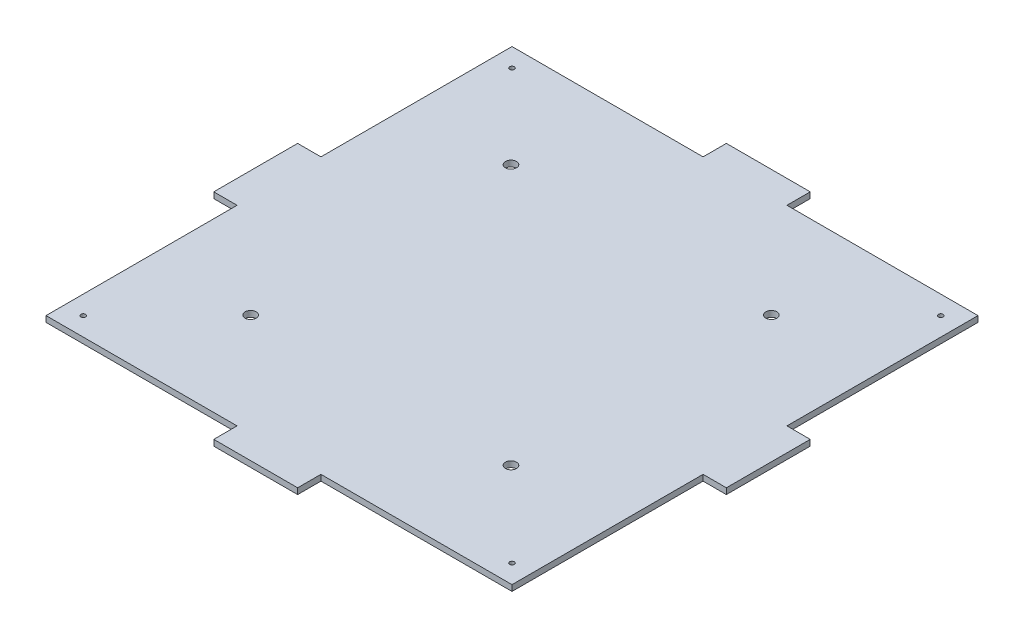
ISO-10303-21;
HEADER;
FILE_DESCRIPTION(('STEP AP214'),'2;1');
FILE_NAME('part.step','',(''),(''),'','','');
FILE_SCHEMA(('AUTOMOTIVE_DESIGN { 1 0 10303 214 1 1 1 1 }'));
ENDSEC;
DATA;
#1=APPLICATION_CONTEXT('core data for automotive mechanical design processes');
#2=APPLICATION_PROTOCOL_DEFINITION('international standard','automotive_design',2000,#1);
#3=PRODUCT_CONTEXT('',#1,'mechanical');
#4=PRODUCT('Part','Part','',(#3));
#5=PRODUCT_RELATED_PRODUCT_CATEGORY('part','',(#4));
#6=PRODUCT_DEFINITION_FORMATION('','',#4);
#7=PRODUCT_DEFINITION_CONTEXT('part definition',#1,'design');
#8=PRODUCT_DEFINITION('design','',#6,#7);
#9=PRODUCT_DEFINITION_SHAPE('','',#8);
#10=(LENGTH_UNIT() NAMED_UNIT(*) SI_UNIT(.MILLI.,.METRE.));
#11=(NAMED_UNIT(*) PLANE_ANGLE_UNIT() SI_UNIT($,.RADIAN.));
#12=(NAMED_UNIT(*) SI_UNIT($,.STERADIAN.) SOLID_ANGLE_UNIT());
#13=UNCERTAINTY_MEASURE_WITH_UNIT(LENGTH_MEASURE(1.E-05),#10,'distance_accuracy_value','');
#14=(GEOMETRIC_REPRESENTATION_CONTEXT(3) GLOBAL_UNCERTAINTY_ASSIGNED_CONTEXT((#13)) GLOBAL_UNIT_ASSIGNED_CONTEXT((#10,
#11,#12)) REPRESENTATION_CONTEXT('',''));
#15=CARTESIAN_POINT('',(0.,0.,0.));
#16=DIRECTION('',(0.,0.,1.));
#17=DIRECTION('',(1.,0.,0.));
#18=AXIS2_PLACEMENT_3D('',#15,#16,#17);
#19=CARTESIAN_POINT('',(0.,3.175,0.));
#20=DIRECTION('',(0.,-1.,0.));
#21=DIRECTION('',(0.,0.,-1.));
#22=AXIS2_PLACEMENT_3D('',#19,#20,#21);
#23=PLANE('',#22);
#24=CARTESIAN_POINT('',(69.2965591226744,3.175,69.85));
#25=DIRECTION('',(0.,1.,0.));
#26=DIRECTION('',(0.,0.,1.));
#27=AXIS2_PLACEMENT_3D('',#24,#25,#26);
#28=CIRCLE('',#27,2.9718);
#29=CARTESIAN_POINT('',(69.2965591226744,3.175,72.8218));
#30=VERTEX_POINT('',#29);
#31=EDGE_CURVE('E758',#30,#30,#28,.T.);
#32=ORIENTED_EDGE('',*,*,#31,.F.);
#33=EDGE_LOOP('',(#32));
#34=FACE_BOUND('',#33,.T.);
#35=CARTESIAN_POINT('',(69.2965591226744,3.175,-69.85));
#36=DIRECTION('',(0.,1.,0.));
#37=DIRECTION('',(0.,0.,1.));
#38=AXIS2_PLACEMENT_3D('',#35,#36,#37);
#39=CIRCLE('',#38,2.9718);
#40=CARTESIAN_POINT('',(69.2965591226744,3.175,-66.8782));
#41=VERTEX_POINT('',#40);
#42=EDGE_CURVE('E761',#41,#41,#39,.T.);
#43=ORIENTED_EDGE('',*,*,#42,.F.);
#44=EDGE_LOOP('',(#43));
#45=FACE_BOUND('',#44,.T.);
#46=CARTESIAN_POINT('',(-70.4034408773256,3.175,-69.85));
#47=DIRECTION('',(0.,1.,0.));
#48=DIRECTION('',(0.,0.,1.));
#49=AXIS2_PLACEMENT_3D('',#46,#47,#48);
#50=CIRCLE('',#49,2.9718);
#51=CARTESIAN_POINT('',(-70.4034408773256,3.175,-66.8782));
#52=VERTEX_POINT('',#51);
#53=EDGE_CURVE('E757',#52,#52,#50,.T.);
#54=ORIENTED_EDGE('',*,*,#53,.F.);
#55=EDGE_LOOP('',(#54));
#56=FACE_BOUND('',#55,.T.);
#57=CARTESIAN_POINT('',(-70.4034408773255,3.175,69.85));
#58=DIRECTION('',(0.,1.,0.));
#59=DIRECTION('',(0.,0.,1.));
#60=AXIS2_PLACEMENT_3D('',#57,#58,#59);
#61=CIRCLE('',#60,2.9718);
#62=CARTESIAN_POINT('',(-70.4034408773255,3.175,72.8218));
#63=VERTEX_POINT('',#62);
#64=EDGE_CURVE('E337',#63,#63,#61,.T.);
#65=ORIENTED_EDGE('',*,*,#64,.F.);
#66=EDGE_LOOP('',(#65));
#67=FACE_BOUND('',#66,.T.);
#68=CARTESIAN_POINT('',(115.,3.175,-115.));
#69=DIRECTION('',(0.,1.,0.));
#70=DIRECTION('',(0.,0.,1.));
#71=AXIS2_PLACEMENT_3D('',#68,#69,#70);
#72=CIRCLE('',#71,1.25000000000003);
#73=CARTESIAN_POINT('',(115.,3.175,-113.75));
#74=VERTEX_POINT('',#73);
#75=EDGE_CURVE('E326',#74,#74,#72,.F.);
#76=ORIENTED_EDGE('',*,*,#75,.T.);
#77=EDGE_LOOP('',(#76));
#78=FACE_BOUND('',#77,.T.);
#79=DIRECTION('',(0.,0.,-1.));
#80=VECTOR('',#79,1.);
#81=CARTESIAN_POINT('',(125.,3.175,125.));
#82=LINE('',#81,#80);
#83=CARTESIAN_POINT('',(125.,3.175,125.));
#84=VERTEX_POINT('',#83);
#85=CARTESIAN_POINT('',(125.,3.175,22.5));
#86=VERTEX_POINT('',#85);
#87=EDGE_CURVE('E289',#84,#86,#82,.T.);
#88=ORIENTED_EDGE('',*,*,#87,.T.);
#89=DIRECTION('',(-1.,0.,0.));
#90=VECTOR('',#89,1.);
#91=CARTESIAN_POINT('',(137.5,3.175,22.5));
#92=LINE('',#91,#90);
#93=CARTESIAN_POINT('',(137.5,3.175,22.5));
#94=VERTEX_POINT('',#93);
#95=EDGE_CURVE('E186',#94,#86,#92,.T.);
#96=ORIENTED_EDGE('',*,*,#95,.F.);
#97=DIRECTION('',(0.,0.,1.));
#98=VECTOR('',#97,1.);
#99=CARTESIAN_POINT('',(137.5,3.175,22.5));
#100=LINE('',#99,#98);
#101=CARTESIAN_POINT('',(137.5,3.175,-22.5));
#102=VERTEX_POINT('',#101);
#103=EDGE_CURVE('E179',#102,#94,#100,.T.);
#104=ORIENTED_EDGE('',*,*,#103,.F.);
#105=DIRECTION('',(-1.,0.,0.));
#106=VECTOR('',#105,1.);
#107=CARTESIAN_POINT('',(137.5,3.175,-22.5));
#108=LINE('',#107,#106);
#109=CARTESIAN_POINT('',(125.,3.175,-22.5));
#110=VERTEX_POINT('',#109);
#111=EDGE_CURVE('E183',#102,#110,#108,.T.);
#112=ORIENTED_EDGE('',*,*,#111,.T.);
#113=CARTESIAN_POINT('',(125.,3.175,-125.));
#114=VERTEX_POINT('',#113);
#115=EDGE_CURVE('E57',#110,#114,#82,.T.);
#116=ORIENTED_EDGE('',*,*,#115,.T.);
#117=DIRECTION('',(-1.,0.,0.));
#118=VECTOR('',#117,1.);
#119=CARTESIAN_POINT('',(-125.,3.175,-125.));
#120=LINE('',#119,#118);
#121=CARTESIAN_POINT('',(22.5,3.175,-125.));
#122=VERTEX_POINT('',#121);
#123=EDGE_CURVE('E292',#114,#122,#120,.T.);
#124=ORIENTED_EDGE('',*,*,#123,.T.);
#125=DIRECTION('',(0.,0.,1.));
#126=VECTOR('',#125,1.);
#127=CARTESIAN_POINT('',(22.5,3.175,-137.5));
#128=LINE('',#127,#126);
#129=CARTESIAN_POINT('',(22.5,3.175,-137.5));
#130=VERTEX_POINT('',#129);
#131=EDGE_CURVE('E282',#130,#122,#128,.T.);
#132=ORIENTED_EDGE('',*,*,#131,.F.);
#133=DIRECTION('',(1.,0.,0.));
#134=VECTOR('',#133,1.);
#135=CARTESIAN_POINT('',(22.5,3.175,-137.5));
#136=LINE('',#135,#134);
#137=CARTESIAN_POINT('',(-22.5,3.175,-137.5));
#138=VERTEX_POINT('',#137);
#139=EDGE_CURVE('E265',#138,#130,#136,.T.);
#140=ORIENTED_EDGE('',*,*,#139,.F.);
#141=DIRECTION('',(0.,0.,1.));
#142=VECTOR('',#141,1.);
#143=CARTESIAN_POINT('',(-22.5,3.175,-137.5));
#144=LINE('',#143,#142);
#145=CARTESIAN_POINT('',(-22.5,3.175,-125.));
#146=VERTEX_POINT('',#145);
#147=EDGE_CURVE('E285',#138,#146,#144,.T.);
#148=ORIENTED_EDGE('',*,*,#147,.T.);
#149=CARTESIAN_POINT('',(-125.,3.175,-125.));
#150=VERTEX_POINT('',#149);
#151=EDGE_CURVE('E291',#146,#150,#120,.T.);
#152=ORIENTED_EDGE('',*,*,#151,.T.);
#153=DIRECTION('',(0.,0.,1.));
#154=VECTOR('',#153,1.);
#155=CARTESIAN_POINT('',(-125.,3.175,125.));
#156=LINE('',#155,#154);
#157=CARTESIAN_POINT('',(-125.,3.175,-22.5));
#158=VERTEX_POINT('',#157);
#159=EDGE_CURVE('E296',#150,#158,#156,.T.);
#160=ORIENTED_EDGE('',*,*,#159,.T.);
#161=DIRECTION('',(1.,0.,0.));
#162=VECTOR('',#161,1.);
#163=CARTESIAN_POINT('',(-137.5,3.175,-22.5));
#164=LINE('',#163,#162);
#165=CARTESIAN_POINT('',(-137.5,3.175,-22.5));
#166=VERTEX_POINT('',#165);
#167=EDGE_CURVE('E255',#166,#158,#164,.T.);
#168=ORIENTED_EDGE('',*,*,#167,.F.);
#169=DIRECTION('',(0.,0.,-1.));
#170=VECTOR('',#169,1.);
#171=CARTESIAN_POINT('',(-137.5,3.175,-22.5));
#172=LINE('',#171,#170);
#173=CARTESIAN_POINT('',(-137.5,3.175,22.5));
#174=VERTEX_POINT('',#173);
#175=EDGE_CURVE('E238',#174,#166,#172,.T.);
#176=ORIENTED_EDGE('',*,*,#175,.F.);
#177=DIRECTION('',(1.,0.,0.));
#178=VECTOR('',#177,1.);
#179=CARTESIAN_POINT('',(-137.5,3.175,22.5));
#180=LINE('',#179,#178);
#181=CARTESIAN_POINT('',(-125.,3.175,22.5));
#182=VERTEX_POINT('',#181);
#183=EDGE_CURVE('E258',#174,#182,#180,.T.);
#184=ORIENTED_EDGE('',*,*,#183,.T.);
#185=CARTESIAN_POINT('',(-125.,3.175,125.));
#186=VERTEX_POINT('',#185);
#187=EDGE_CURVE('E295',#182,#186,#156,.T.);
#188=ORIENTED_EDGE('',*,*,#187,.T.);
#189=DIRECTION('',(1.,0.,0.));
#190=VECTOR('',#189,1.);
#191=CARTESIAN_POINT('',(-125.,3.175,125.));
#192=LINE('',#191,#190);
#193=CARTESIAN_POINT('',(-22.5,3.175,125.));
#194=VERTEX_POINT('',#193);
#195=EDGE_CURVE('E300',#186,#194,#192,.T.);
#196=ORIENTED_EDGE('',*,*,#195,.T.);
#197=DIRECTION('',(0.,0.,-1.));
#198=VECTOR('',#197,1.);
#199=CARTESIAN_POINT('',(-22.5,3.175,137.5));
#200=LINE('',#199,#198);
#201=CARTESIAN_POINT('',(-22.5,3.175,137.5));
#202=VERTEX_POINT('',#201);
#203=EDGE_CURVE('E228',#202,#194,#200,.T.);
#204=ORIENTED_EDGE('',*,*,#203,.F.);
#205=DIRECTION('',(-1.,0.,0.));
#206=VECTOR('',#205,1.);
#207=CARTESIAN_POINT('',(-22.5,3.175,137.5));
#208=LINE('',#207,#206);
#209=CARTESIAN_POINT('',(22.5,3.175,137.5));
#210=VERTEX_POINT('',#209);
#211=EDGE_CURVE('E214',#210,#202,#208,.T.);
#212=ORIENTED_EDGE('',*,*,#211,.F.);
#213=DIRECTION('',(0.,0.,-1.));
#214=VECTOR('',#213,1.);
#215=CARTESIAN_POINT('',(22.5,3.175,137.5));
#216=LINE('',#215,#214);
#217=CARTESIAN_POINT('',(22.5,3.175,125.));
#218=VERTEX_POINT('',#217);
#219=EDGE_CURVE('E231',#210,#218,#216,.T.);
#220=ORIENTED_EDGE('',*,*,#219,.T.);
#221=EDGE_CURVE('E299',#218,#84,#192,.T.);
#222=ORIENTED_EDGE('',*,*,#221,.T.);
#223=EDGE_LOOP('',(#88,#96,#104,#112,#116,#124,#132,#140,#148,#152,#160,#168,#176,#184,#188,
#196,#204,#212,#220,#222));
#224=FACE_BOUND('',#223,.T.);
#225=CARTESIAN_POINT('',(-115.,3.175,-115.));
#226=DIRECTION('',(0.,1.,0.));
#227=DIRECTION('',(0.,0.,1.));
#228=AXIS2_PLACEMENT_3D('',#225,#226,#227);
#229=CIRCLE('',#228,1.25);
#230=CARTESIAN_POINT('',(-115.,3.175,-113.75));
#231=VERTEX_POINT('',#230);
#232=EDGE_CURVE('E332',#231,#231,#229,.T.);
#233=ORIENTED_EDGE('',*,*,#232,.F.);
#234=EDGE_LOOP('',(#233));
#235=FACE_BOUND('',#234,.T.);
#236=CARTESIAN_POINT('',(-115.,3.175,115.));
#237=DIRECTION('',(0.,-1.,0.));
#238=DIRECTION('',(0.,0.,-1.));
#239=AXIS2_PLACEMENT_3D('',#236,#237,#238);
#240=CIRCLE('',#239,1.25);
#241=CARTESIAN_POINT('',(-115.,3.175,113.75));
#242=VERTEX_POINT('',#241);
#243=EDGE_CURVE('E344',#242,#242,#240,.T.);
#244=ORIENTED_EDGE('',*,*,#243,.T.);
#245=EDGE_LOOP('',(#244));
#246=FACE_BOUND('',#245,.T.);
#247=CARTESIAN_POINT('',(115.,3.175,115.));
#248=DIRECTION('',(0.,1.,0.));
#249=DIRECTION('',(0.,0.,1.));
#250=AXIS2_PLACEMENT_3D('',#247,#248,#249);
#251=CIRCLE('',#250,1.25000000000003);
#252=CARTESIAN_POINT('',(115.,3.175,116.25));
#253=VERTEX_POINT('',#252);
#254=EDGE_CURVE('E348',#253,#253,#251,.T.);
#255=ORIENTED_EDGE('',*,*,#254,.F.);
#256=EDGE_LOOP('',(#255));
#257=FACE_BOUND('',#256,.T.);
#258=ADVANCED_FACE('F40',(#34,#45,#56,#67,#78,#224,#235,#246,#257),#23,.F.);
#259=CARTESIAN_POINT('',(0.,0.,0.));
#260=DIRECTION('',(0.,-1.,0.));
#261=DIRECTION('',(0.,0.,-1.));
#262=AXIS2_PLACEMENT_3D('',#259,#260,#261);
#263=PLANE('',#262);
#264=CARTESIAN_POINT('',(69.2965591226744,0.,69.85));
#265=DIRECTION('',(0.,-1.,0.));
#266=DIRECTION('',(0.,0.,-1.));
#267=AXIS2_PLACEMENT_3D('',#264,#265,#266);
#268=CIRCLE('',#267,2.9718);
#269=CARTESIAN_POINT('',(69.2965591226744,0.,66.8782));
#270=VERTEX_POINT('',#269);
#271=EDGE_CURVE('E44',#270,#270,#268,.T.);
#272=ORIENTED_EDGE('',*,*,#271,.F.);
#273=EDGE_LOOP('',(#272));
#274=FACE_BOUND('',#273,.T.);
#275=CARTESIAN_POINT('',(69.2965591226744,0.,-69.85));
#276=DIRECTION('',(0.,-1.,0.));
#277=DIRECTION('',(0.,0.,-1.));
#278=AXIS2_PLACEMENT_3D('',#275,#276,#277);
#279=CIRCLE('',#278,2.9718);
#280=CARTESIAN_POINT('',(69.2965591226744,0.,-72.8218));
#281=VERTEX_POINT('',#280);
#282=EDGE_CURVE('E339',#281,#281,#279,.T.);
#283=ORIENTED_EDGE('',*,*,#282,.F.);
#284=EDGE_LOOP('',(#283));
#285=FACE_BOUND('',#284,.T.);
#286=CARTESIAN_POINT('',(-70.4034408773256,0.,-69.85));
#287=DIRECTION('',(0.,-1.,0.));
#288=DIRECTION('',(0.,0.,-1.));
#289=AXIS2_PLACEMENT_3D('',#286,#287,#288);
#290=CIRCLE('',#289,2.9718);
#291=CARTESIAN_POINT('',(-70.4034408773256,0.,-72.8218));
#292=VERTEX_POINT('',#291);
#293=EDGE_CURVE('E336',#292,#292,#290,.T.);
#294=ORIENTED_EDGE('',*,*,#293,.F.);
#295=EDGE_LOOP('',(#294));
#296=FACE_BOUND('',#295,.T.);
#297=CARTESIAN_POINT('',(-70.4034408773255,0.,69.85));
#298=DIRECTION('',(0.,-1.,0.));
#299=DIRECTION('',(0.,0.,-1.));
#300=AXIS2_PLACEMENT_3D('',#297,#298,#299);
#301=CIRCLE('',#300,2.9718);
#302=CARTESIAN_POINT('',(-70.4034408773255,0.,66.8782));
#303=VERTEX_POINT('',#302);
#304=EDGE_CURVE('E333',#303,#303,#301,.T.);
#305=ORIENTED_EDGE('',*,*,#304,.F.);
#306=EDGE_LOOP('',(#305));
#307=FACE_BOUND('',#306,.T.);
#308=CARTESIAN_POINT('',(115.,0.,-115.));
#309=DIRECTION('',(0.,-1.,0.));
#310=DIRECTION('',(0.,0.,-1.));
#311=AXIS2_PLACEMENT_3D('',#308,#309,#310);
#312=CIRCLE('',#311,1.25000000000003);
#313=CARTESIAN_POINT('',(115.,0.,-116.25));
#314=VERTEX_POINT('',#313);
#315=EDGE_CURVE('E329',#314,#314,#312,.F.);
#316=ORIENTED_EDGE('',*,*,#315,.T.);
#317=EDGE_LOOP('',(#316));
#318=FACE_BOUND('',#317,.T.);
#319=CARTESIAN_POINT('',(-115.,0.,115.));
#320=DIRECTION('',(0.,-1.,0.));
#321=DIRECTION('',(0.,0.,-1.));
#322=AXIS2_PLACEMENT_3D('',#319,#320,#321);
#323=CIRCLE('',#322,1.25);
#324=CARTESIAN_POINT('',(-115.,0.,113.75));
#325=VERTEX_POINT('',#324);
#326=EDGE_CURVE('E322',#325,#325,#323,.F.);
#327=ORIENTED_EDGE('',*,*,#326,.T.);
#328=EDGE_LOOP('',(#327));
#329=FACE_BOUND('',#328,.T.);
#330=CARTESIAN_POINT('',(-115.,0.,-115.));
#331=DIRECTION('',(0.,1.,0.));
#332=DIRECTION('',(0.,0.,1.));
#333=AXIS2_PLACEMENT_3D('',#330,#331,#332);
#334=CIRCLE('',#333,1.25);
#335=CARTESIAN_POINT('',(-115.,0.,-113.75));
#336=VERTEX_POINT('',#335);
#337=EDGE_CURVE('E358',#336,#336,#334,.T.);
#338=ORIENTED_EDGE('',*,*,#337,.T.);
#339=EDGE_LOOP('',(#338));
#340=FACE_BOUND('',#339,.T.);
#341=DIRECTION('',(0.,0.,-1.));
#342=VECTOR('',#341,1.);
#343=CARTESIAN_POINT('',(125.,0.,125.));
#344=LINE('',#343,#342);
#345=CARTESIAN_POINT('',(125.,0.,125.));
#346=VERTEX_POINT('',#345);
#347=CARTESIAN_POINT('',(125.,0.,22.5));
#348=VERTEX_POINT('',#347);
#349=EDGE_CURVE('E304',#346,#348,#344,.T.);
#350=ORIENTED_EDGE('',*,*,#349,.F.);
#351=DIRECTION('',(1.,0.,0.));
#352=VECTOR('',#351,1.);
#353=CARTESIAN_POINT('',(-125.,0.,125.));
#354=LINE('',#353,#352);
#355=CARTESIAN_POINT('',(22.5,0.,125.));
#356=VERTEX_POINT('',#355);
#357=EDGE_CURVE('E312',#356,#346,#354,.T.);
#358=ORIENTED_EDGE('',*,*,#357,.F.);
#359=DIRECTION('',(0.,0.,-1.));
#360=VECTOR('',#359,1.);
#361=CARTESIAN_POINT('',(22.5,0.,137.5));
#362=LINE('',#361,#360);
#363=CARTESIAN_POINT('',(22.5,0.,137.5));
#364=VERTEX_POINT('',#363);
#365=EDGE_CURVE('E219',#364,#356,#362,.T.);
#366=ORIENTED_EDGE('',*,*,#365,.F.);
#367=DIRECTION('',(1.,0.,0.));
#368=VECTOR('',#367,1.);
#369=CARTESIAN_POINT('',(-22.5,0.,137.5));
#370=LINE('',#369,#368);
#371=CARTESIAN_POINT('',(-22.5,0.,137.5));
#372=VERTEX_POINT('',#371);
#373=EDGE_CURVE('E218',#372,#364,#370,.T.);
#374=ORIENTED_EDGE('',*,*,#373,.F.);
#375=DIRECTION('',(0.,0.,-1.));
#376=VECTOR('',#375,1.);
#377=CARTESIAN_POINT('',(-22.5,0.,137.5));
#378=LINE('',#377,#376);
#379=CARTESIAN_POINT('',(-22.5,0.,125.));
#380=VERTEX_POINT('',#379);
#381=EDGE_CURVE('E225',#372,#380,#378,.T.);
#382=ORIENTED_EDGE('',*,*,#381,.T.);
#383=CARTESIAN_POINT('',(-125.,0.,125.));
#384=VERTEX_POINT('',#383);
#385=EDGE_CURVE('E313',#384,#380,#354,.T.);
#386=ORIENTED_EDGE('',*,*,#385,.F.);
#387=DIRECTION('',(0.,0.,1.));
#388=VECTOR('',#387,1.);
#389=CARTESIAN_POINT('',(-125.,0.,125.));
#390=LINE('',#389,#388);
#391=CARTESIAN_POINT('',(-125.,0.,22.5));
#392=VERTEX_POINT('',#391);
#393=EDGE_CURVE('E309',#392,#384,#390,.T.);
#394=ORIENTED_EDGE('',*,*,#393,.F.);
#395=DIRECTION('',(1.,0.,0.));
#396=VECTOR('',#395,1.);
#397=CARTESIAN_POINT('',(-137.5,0.,22.5));
#398=LINE('',#397,#396);
#399=CARTESIAN_POINT('',(-137.5,0.,22.5));
#400=VERTEX_POINT('',#399);
#401=EDGE_CURVE('E245',#400,#392,#398,.T.);
#402=ORIENTED_EDGE('',*,*,#401,.F.);
#403=DIRECTION('',(0.,0.,1.));
#404=VECTOR('',#403,1.);
#405=CARTESIAN_POINT('',(-137.5,0.,-22.5));
#406=LINE('',#405,#404);
#407=CARTESIAN_POINT('',(-137.5,0.,-22.5));
#408=VERTEX_POINT('',#407);
#409=EDGE_CURVE('E243',#408,#400,#406,.T.);
#410=ORIENTED_EDGE('',*,*,#409,.F.);
#411=DIRECTION('',(1.,0.,0.));
#412=VECTOR('',#411,1.);
#413=CARTESIAN_POINT('',(-137.5,0.,-22.5));
#414=LINE('',#413,#412);
#415=CARTESIAN_POINT('',(-125.,0.,-22.5));
#416=VERTEX_POINT('',#415);
#417=EDGE_CURVE('E252',#408,#416,#414,.T.);
#418=ORIENTED_EDGE('',*,*,#417,.T.);
#419=CARTESIAN_POINT('',(-125.,0.,-125.));
#420=VERTEX_POINT('',#419);
#421=EDGE_CURVE('E310',#420,#416,#390,.T.);
#422=ORIENTED_EDGE('',*,*,#421,.F.);
#423=DIRECTION('',(-1.,0.,0.));
#424=VECTOR('',#423,1.);
#425=CARTESIAN_POINT('',(-125.,0.,-125.));
#426=LINE('',#425,#424);
#427=CARTESIAN_POINT('',(-22.5,0.,-125.));
#428=VERTEX_POINT('',#427);
#429=EDGE_CURVE('E306',#428,#420,#426,.T.);
#430=ORIENTED_EDGE('',*,*,#429,.F.);
#431=DIRECTION('',(0.,0.,1.));
#432=VECTOR('',#431,1.);
#433=CARTESIAN_POINT('',(-22.5,0.,-137.5));
#434=LINE('',#433,#432);
#435=CARTESIAN_POINT('',(-22.5,0.,-137.5));
#436=VERTEX_POINT('',#435);
#437=EDGE_CURVE('E272',#436,#428,#434,.T.);
#438=ORIENTED_EDGE('',*,*,#437,.F.);
#439=DIRECTION('',(-1.,0.,0.));
#440=VECTOR('',#439,1.);
#441=CARTESIAN_POINT('',(22.5,0.,-137.5));
#442=LINE('',#441,#440);
#443=CARTESIAN_POINT('',(22.5,0.,-137.5));
#444=VERTEX_POINT('',#443);
#445=EDGE_CURVE('E270',#444,#436,#442,.T.);
#446=ORIENTED_EDGE('',*,*,#445,.F.);
#447=DIRECTION('',(0.,0.,1.));
#448=VECTOR('',#447,1.);
#449=CARTESIAN_POINT('',(22.5,0.,-137.5));
#450=LINE('',#449,#448);
#451=CARTESIAN_POINT('',(22.5,0.,-125.));
#452=VERTEX_POINT('',#451);
#453=EDGE_CURVE('E279',#444,#452,#450,.T.);
#454=ORIENTED_EDGE('',*,*,#453,.T.);
#455=CARTESIAN_POINT('',(125.,0.,-125.));
#456=VERTEX_POINT('',#455);
#457=EDGE_CURVE('E307',#456,#452,#426,.T.);
#458=ORIENTED_EDGE('',*,*,#457,.F.);
#459=CARTESIAN_POINT('',(125.,0.,-22.5));
#460=VERTEX_POINT('',#459);
#461=EDGE_CURVE('E288',#460,#456,#344,.T.);
#462=ORIENTED_EDGE('',*,*,#461,.F.);
#463=DIRECTION('',(-1.,0.,0.));
#464=VECTOR('',#463,1.);
#465=CARTESIAN_POINT('',(137.5,0.,-22.5));
#466=LINE('',#465,#464);
#467=CARTESIAN_POINT('',(137.5,0.,-22.5));
#468=VERTEX_POINT('',#467);
#469=EDGE_CURVE('E363',#468,#460,#466,.T.);
#470=ORIENTED_EDGE('',*,*,#469,.F.);
#471=DIRECTION('',(0.,0.,-1.));
#472=VECTOR('',#471,1.);
#473=CARTESIAN_POINT('',(137.5,0.,22.5));
#474=LINE('',#473,#472);
#475=CARTESIAN_POINT('',(137.5,0.,22.5));
#476=VERTEX_POINT('',#475);
#477=EDGE_CURVE('E195',#476,#468,#474,.T.);
#478=ORIENTED_EDGE('',*,*,#477,.F.);
#479=DIRECTION('',(-1.,0.,0.));
#480=VECTOR('',#479,1.);
#481=CARTESIAN_POINT('',(137.5,0.,22.5));
#482=LINE('',#481,#480);
#483=EDGE_CURVE('E207',#476,#348,#482,.T.);
#484=ORIENTED_EDGE('',*,*,#483,.T.);
#485=EDGE_LOOP('',(#350,#358,#366,#374,#382,#386,#394,#402,#410,#418,#422,#430,#438,#446,#454,
#458,#462,#470,#478,#484));
#486=FACE_BOUND('',#485,.T.);
#487=CARTESIAN_POINT('',(115.,0.,115.));
#488=DIRECTION('',(0.,-1.,0.));
#489=DIRECTION('',(0.,0.,-1.));
#490=AXIS2_PLACEMENT_3D('',#487,#488,#489);
#491=CIRCLE('',#490,1.25000000000003);
#492=CARTESIAN_POINT('',(115.,0.,113.75));
#493=VERTEX_POINT('',#492);
#494=EDGE_CURVE('E325',#493,#493,#491,.T.);
#495=ORIENTED_EDGE('',*,*,#494,.F.);
#496=EDGE_LOOP('',(#495));
#497=FACE_BOUND('',#496,.T.);
#498=ADVANCED_FACE('F370',(#274,#285,#296,#307,#318,#329,#340,#486,#497),#263,.T.);
#499=CARTESIAN_POINT('',(125.,3.175,125.));
#500=DIRECTION('',(-1.,0.,0.));
#501=DIRECTION('',(0.,0.,1.));
#502=AXIS2_PLACEMENT_3D('',#499,#500,#501);
#503=PLANE('',#502);
#504=DIRECTION('',(0.,1.,0.));
#505=VECTOR('',#504,1.);
#506=CARTESIAN_POINT('',(125.,0.,-22.5));
#507=LINE('',#506,#505);
#508=EDGE_CURVE('E201',#460,#110,#507,.T.);
#509=ORIENTED_EDGE('',*,*,#508,.F.);
#510=ORIENTED_EDGE('',*,*,#461,.T.);
#511=DIRECTION('',(0.,-1.,0.));
#512=VECTOR('',#511,1.);
#513=CARTESIAN_POINT('',(125.,3.175,-125.));
#514=LINE('',#513,#512);
#515=EDGE_CURVE('E11',#114,#456,#514,.T.);
#516=ORIENTED_EDGE('',*,*,#515,.F.);
#517=ORIENTED_EDGE('',*,*,#115,.F.);
#518=EDGE_LOOP('',(#509,#510,#516,#517));
#519=FACE_BOUND('',#518,.T.);
#520=ADVANCED_FACE('F42',(#519),#503,.F.);
#521=DIRECTION('',(0.,-1.,0.));
#522=VECTOR('',#521,1.);
#523=CARTESIAN_POINT('',(125.,0.,22.5));
#524=LINE('',#523,#522);
#525=EDGE_CURVE('E65',#86,#348,#524,.T.);
#526=ORIENTED_EDGE('',*,*,#525,.F.);
#527=ORIENTED_EDGE('',*,*,#87,.F.);
#528=DIRECTION('',(0.,-1.,0.));
#529=VECTOR('',#528,1.);
#530=CARTESIAN_POINT('',(125.,3.175,125.));
#531=LINE('',#530,#529);
#532=EDGE_CURVE('E303',#84,#346,#531,.T.);
#533=ORIENTED_EDGE('',*,*,#532,.T.);
#534=ORIENTED_EDGE('',*,*,#349,.T.);
#535=EDGE_LOOP('',(#526,#527,#533,#534));
#536=FACE_BOUND('',#535,.T.);
#537=ADVANCED_FACE('F403',(#536),#503,.F.);
#538=CARTESIAN_POINT('',(-125.,3.175,125.));
#539=DIRECTION('',(0.,0.,-1.));
#540=DIRECTION('',(-1.,0.,0.));
#541=AXIS2_PLACEMENT_3D('',#538,#539,#540);
#542=PLANE('',#541);
#543=DIRECTION('',(0.,1.,0.));
#544=VECTOR('',#543,1.);
#545=CARTESIAN_POINT('',(22.5,0.,125.));
#546=LINE('',#545,#544);
#547=EDGE_CURVE('E202',#356,#218,#546,.T.);
#548=ORIENTED_EDGE('',*,*,#547,.F.);
#549=ORIENTED_EDGE('',*,*,#357,.T.);
#550=ORIENTED_EDGE('',*,*,#532,.F.);
#551=ORIENTED_EDGE('',*,*,#221,.F.);
#552=EDGE_LOOP('',(#548,#549,#550,#551));
#553=FACE_BOUND('',#552,.T.);
#554=ADVANCED_FACE('F399',(#553),#542,.F.);
#555=DIRECTION('',(0.,-1.,0.));
#556=VECTOR('',#555,1.);
#557=CARTESIAN_POINT('',(-22.5,0.,125.));
#558=LINE('',#557,#556);
#559=EDGE_CURVE('E205',#194,#380,#558,.T.);
#560=ORIENTED_EDGE('',*,*,#559,.F.);
#561=ORIENTED_EDGE('',*,*,#195,.F.);
#562=DIRECTION('',(0.,-1.,0.));
#563=VECTOR('',#562,1.);
#564=CARTESIAN_POINT('',(-125.,3.175,125.));
#565=LINE('',#564,#563);
#566=EDGE_CURVE('E317',#186,#384,#565,.T.);
#567=ORIENTED_EDGE('',*,*,#566,.T.);
#568=ORIENTED_EDGE('',*,*,#385,.T.);
#569=EDGE_LOOP('',(#560,#561,#567,#568));
#570=FACE_BOUND('',#569,.T.);
#571=ADVANCED_FACE('F402',(#570),#542,.F.);
#572=CARTESIAN_POINT('',(-125.,3.175,125.));
#573=DIRECTION('',(1.,0.,0.));
#574=DIRECTION('',(0.,0.,-1.));
#575=AXIS2_PLACEMENT_3D('',#572,#573,#574);
#576=PLANE('',#575);
#577=DIRECTION('',(0.,1.,0.));
#578=VECTOR('',#577,1.);
#579=CARTESIAN_POINT('',(-125.,0.,22.5));
#580=LINE('',#579,#578);
#581=EDGE_CURVE('E234',#392,#182,#580,.T.);
#582=ORIENTED_EDGE('',*,*,#581,.F.);
#583=ORIENTED_EDGE('',*,*,#393,.T.);
#584=ORIENTED_EDGE('',*,*,#566,.F.);
#585=ORIENTED_EDGE('',*,*,#187,.F.);
#586=EDGE_LOOP('',(#582,#583,#584,#585));
#587=FACE_BOUND('',#586,.T.);
#588=ADVANCED_FACE('F405',(#587),#576,.F.);
#589=DIRECTION('',(0.,-1.,0.));
#590=VECTOR('',#589,1.);
#591=CARTESIAN_POINT('',(-125.,0.,-22.5));
#592=LINE('',#591,#590);
#593=EDGE_CURVE('E239',#158,#416,#592,.T.);
#594=ORIENTED_EDGE('',*,*,#593,.F.);
#595=ORIENTED_EDGE('',*,*,#159,.F.);
#596=DIRECTION('',(0.,-1.,0.));
#597=VECTOR('',#596,1.);
#598=CARTESIAN_POINT('',(-125.,3.175,-125.));
#599=LINE('',#598,#597);
#600=EDGE_CURVE('E49',#150,#420,#599,.T.);
#601=ORIENTED_EDGE('',*,*,#600,.T.);
#602=ORIENTED_EDGE('',*,*,#421,.T.);
#603=EDGE_LOOP('',(#594,#595,#601,#602));
#604=FACE_BOUND('',#603,.T.);
#605=ADVANCED_FACE('F407',(#604),#576,.F.);
#606=CARTESIAN_POINT('',(-125.,3.175,-125.));
#607=DIRECTION('',(0.,0.,1.));
#608=DIRECTION('',(1.,0.,0.));
#609=AXIS2_PLACEMENT_3D('',#606,#607,#608);
#610=PLANE('',#609);
#611=DIRECTION('',(0.,1.,0.));
#612=VECTOR('',#611,1.);
#613=CARTESIAN_POINT('',(-22.5,0.,-125.));
#614=LINE('',#613,#612);
#615=EDGE_CURVE('E261',#428,#146,#614,.T.);
#616=ORIENTED_EDGE('',*,*,#615,.F.);
#617=ORIENTED_EDGE('',*,*,#429,.T.);
#618=ORIENTED_EDGE('',*,*,#600,.F.);
#619=ORIENTED_EDGE('',*,*,#151,.F.);
#620=EDGE_LOOP('',(#616,#617,#618,#619));
#621=FACE_BOUND('',#620,.T.);
#622=ADVANCED_FACE('F409',(#621),#610,.F.);
#623=DIRECTION('',(0.,-1.,0.));
#624=VECTOR('',#623,1.);
#625=CARTESIAN_POINT('',(22.5,0.,-125.));
#626=LINE('',#625,#624);
#627=EDGE_CURVE('E266',#122,#452,#626,.T.);
#628=ORIENTED_EDGE('',*,*,#627,.F.);
#629=ORIENTED_EDGE('',*,*,#123,.F.);
#630=ORIENTED_EDGE('',*,*,#515,.T.);
#631=ORIENTED_EDGE('',*,*,#457,.T.);
#632=EDGE_LOOP('',(#628,#629,#630,#631));
#633=FACE_BOUND('',#632,.T.);
#634=ADVANCED_FACE('F411',(#633),#610,.F.);
#635=CARTESIAN_POINT('',(-22.5,0.,-137.5));
#636=DIRECTION('',(1.,0.,0.));
#637=DIRECTION('',(0.,0.,-1.));
#638=AXIS2_PLACEMENT_3D('',#635,#636,#637);
#639=PLANE('',#638);
#640=ORIENTED_EDGE('',*,*,#615,.T.);
#641=ORIENTED_EDGE('',*,*,#147,.F.);
#642=DIRECTION('',(0.,1.,0.));
#643=VECTOR('',#642,1.);
#644=CARTESIAN_POINT('',(-22.5,0.,-137.5));
#645=LINE('',#644,#643);
#646=EDGE_CURVE('E262',#436,#138,#645,.T.);
#647=ORIENTED_EDGE('',*,*,#646,.F.);
#648=ORIENTED_EDGE('',*,*,#437,.T.);
#649=EDGE_LOOP('',(#640,#641,#647,#648));
#650=FACE_BOUND('',#649,.T.);
#651=ADVANCED_FACE('F396',(#650),#639,.F.);
#652=CARTESIAN_POINT('',(22.5,0.,-137.5));
#653=DIRECTION('',(-1.,0.,0.));
#654=DIRECTION('',(0.,0.,1.));
#655=AXIS2_PLACEMENT_3D('',#652,#653,#654);
#656=PLANE('',#655);
#657=ORIENTED_EDGE('',*,*,#627,.T.);
#658=ORIENTED_EDGE('',*,*,#453,.F.);
#659=DIRECTION('',(0.,-1.,0.));
#660=VECTOR('',#659,1.);
#661=CARTESIAN_POINT('',(22.5,0.,-137.5));
#662=LINE('',#661,#660);
#663=EDGE_CURVE('E268',#130,#444,#662,.T.);
#664=ORIENTED_EDGE('',*,*,#663,.F.);
#665=ORIENTED_EDGE('',*,*,#131,.T.);
#666=EDGE_LOOP('',(#657,#658,#664,#665));
#667=FACE_BOUND('',#666,.T.);
#668=ADVANCED_FACE('F435',(#667),#656,.F.);
#669=CARTESIAN_POINT('',(0.,0.,-137.5));
#670=DIRECTION('',(0.,0.,1.));
#671=DIRECTION('',(1.,0.,0.));
#672=AXIS2_PLACEMENT_3D('',#669,#670,#671);
#673=PLANE('',#672);
#674=ORIENTED_EDGE('',*,*,#646,.T.);
#675=ORIENTED_EDGE('',*,*,#139,.T.);
#676=ORIENTED_EDGE('',*,*,#663,.T.);
#677=ORIENTED_EDGE('',*,*,#445,.T.);
#678=EDGE_LOOP('',(#674,#675,#676,#677));
#679=FACE_BOUND('',#678,.T.);
#680=ADVANCED_FACE('F428',(#679),#673,.F.);
#681=CARTESIAN_POINT('',(-137.5,0.,22.5));
#682=DIRECTION('',(0.,0.,-1.));
#683=DIRECTION('',(-1.,0.,0.));
#684=AXIS2_PLACEMENT_3D('',#681,#682,#683);
#685=PLANE('',#684);
#686=ORIENTED_EDGE('',*,*,#581,.T.);
#687=ORIENTED_EDGE('',*,*,#183,.F.);
#688=DIRECTION('',(0.,1.,0.));
#689=VECTOR('',#688,1.);
#690=CARTESIAN_POINT('',(-137.5,0.,22.5));
#691=LINE('',#690,#689);
#692=EDGE_CURVE('E235',#400,#174,#691,.T.);
#693=ORIENTED_EDGE('',*,*,#692,.F.);
#694=ORIENTED_EDGE('',*,*,#401,.T.);
#695=EDGE_LOOP('',(#686,#687,#693,#694));
#696=FACE_BOUND('',#695,.T.);
#697=ADVANCED_FACE('F452',(#696),#685,.F.);
#698=CARTESIAN_POINT('',(-137.5,0.,-22.5));
#699=DIRECTION('',(0.,0.,1.));
#700=DIRECTION('',(1.,0.,0.));
#701=AXIS2_PLACEMENT_3D('',#698,#699,#700);
#702=PLANE('',#701);
#703=ORIENTED_EDGE('',*,*,#593,.T.);
#704=ORIENTED_EDGE('',*,*,#417,.F.);
#705=DIRECTION('',(0.,-1.,0.));
#706=VECTOR('',#705,1.);
#707=CARTESIAN_POINT('',(-137.5,0.,-22.5));
#708=LINE('',#707,#706);
#709=EDGE_CURVE('E241',#166,#408,#708,.T.);
#710=ORIENTED_EDGE('',*,*,#709,.F.);
#711=ORIENTED_EDGE('',*,*,#167,.T.);
#712=EDGE_LOOP('',(#703,#704,#710,#711));
#713=FACE_BOUND('',#712,.T.);
#714=ADVANCED_FACE('F441',(#713),#702,.F.);
#715=CARTESIAN_POINT('',(-137.5,0.,0.));
#716=DIRECTION('',(1.,0.,0.));
#717=DIRECTION('',(0.,0.,-1.));
#718=AXIS2_PLACEMENT_3D('',#715,#716,#717);
#719=PLANE('',#718);
#720=ORIENTED_EDGE('',*,*,#692,.T.);
#721=ORIENTED_EDGE('',*,*,#175,.T.);
#722=ORIENTED_EDGE('',*,*,#709,.T.);
#723=ORIENTED_EDGE('',*,*,#409,.T.);
#724=EDGE_LOOP('',(#720,#721,#722,#723));
#725=FACE_BOUND('',#724,.T.);
#726=ADVANCED_FACE('F448',(#725),#719,.F.);
#727=CARTESIAN_POINT('',(22.5,0.,137.5));
#728=DIRECTION('',(-1.,0.,0.));
#729=DIRECTION('',(0.,0.,1.));
#730=AXIS2_PLACEMENT_3D('',#727,#728,#729);
#731=PLANE('',#730);
#732=ORIENTED_EDGE('',*,*,#547,.T.);
#733=ORIENTED_EDGE('',*,*,#219,.F.);
#734=DIRECTION('',(0.,1.,0.));
#735=VECTOR('',#734,1.);
#736=CARTESIAN_POINT('',(22.5,0.,137.5));
#737=LINE('',#736,#735);
#738=EDGE_CURVE('E211',#364,#210,#737,.T.);
#739=ORIENTED_EDGE('',*,*,#738,.F.);
#740=ORIENTED_EDGE('',*,*,#365,.T.);
#741=EDGE_LOOP('',(#732,#733,#739,#740));
#742=FACE_BOUND('',#741,.T.);
#743=ADVANCED_FACE('F467',(#742),#731,.F.);
#744=CARTESIAN_POINT('',(-22.5,0.,137.5));
#745=DIRECTION('',(1.,0.,0.));
#746=DIRECTION('',(0.,0.,-1.));
#747=AXIS2_PLACEMENT_3D('',#744,#745,#746);
#748=PLANE('',#747);
#749=ORIENTED_EDGE('',*,*,#559,.T.);
#750=ORIENTED_EDGE('',*,*,#381,.F.);
#751=DIRECTION('',(0.,-1.,0.));
#752=VECTOR('',#751,1.);
#753=CARTESIAN_POINT('',(-22.5,0.,137.5));
#754=LINE('',#753,#752);
#755=EDGE_CURVE('E216',#202,#372,#754,.T.);
#756=ORIENTED_EDGE('',*,*,#755,.F.);
#757=ORIENTED_EDGE('',*,*,#203,.T.);
#758=EDGE_LOOP('',(#749,#750,#756,#757));
#759=FACE_BOUND('',#758,.T.);
#760=ADVANCED_FACE('F459',(#759),#748,.F.);
#761=CARTESIAN_POINT('',(0.,0.,137.5));
#762=DIRECTION('',(0.,0.,-1.));
#763=DIRECTION('',(-1.,0.,0.));
#764=AXIS2_PLACEMENT_3D('',#761,#762,#763);
#765=PLANE('',#764);
#766=ORIENTED_EDGE('',*,*,#738,.T.);
#767=ORIENTED_EDGE('',*,*,#211,.T.);
#768=ORIENTED_EDGE('',*,*,#755,.T.);
#769=ORIENTED_EDGE('',*,*,#373,.T.);
#770=EDGE_LOOP('',(#766,#767,#768,#769));
#771=FACE_BOUND('',#770,.T.);
#772=ADVANCED_FACE('F383',(#771),#765,.F.);
#773=CARTESIAN_POINT('',(137.5,0.,-22.5));
#774=DIRECTION('',(0.,0.,1.));
#775=DIRECTION('',(1.,0.,0.));
#776=AXIS2_PLACEMENT_3D('',#773,#774,#775);
#777=PLANE('',#776);
#778=ORIENTED_EDGE('',*,*,#508,.T.);
#779=ORIENTED_EDGE('',*,*,#111,.F.);
#780=DIRECTION('',(0.,1.,0.));
#781=VECTOR('',#780,1.);
#782=CARTESIAN_POINT('',(137.5,0.,-22.5));
#783=LINE('',#782,#781);
#784=EDGE_CURVE('E190',#468,#102,#783,.T.);
#785=ORIENTED_EDGE('',*,*,#784,.F.);
#786=ORIENTED_EDGE('',*,*,#469,.T.);
#787=EDGE_LOOP('',(#778,#779,#785,#786));
#788=FACE_BOUND('',#787,.T.);
#789=ADVANCED_FACE('F200',(#788),#777,.F.);
#790=CARTESIAN_POINT('',(137.5,0.,22.5));
#791=DIRECTION('',(0.,0.,-1.));
#792=DIRECTION('',(-1.,0.,0.));
#793=AXIS2_PLACEMENT_3D('',#790,#791,#792);
#794=PLANE('',#793);
#795=ORIENTED_EDGE('',*,*,#525,.T.);
#796=ORIENTED_EDGE('',*,*,#483,.F.);
#797=DIRECTION('',(0.,-1.,0.));
#798=VECTOR('',#797,1.);
#799=CARTESIAN_POINT('',(137.5,0.,22.5));
#800=LINE('',#799,#798);
#801=EDGE_CURVE('E189',#94,#476,#800,.T.);
#802=ORIENTED_EDGE('',*,*,#801,.F.);
#803=ORIENTED_EDGE('',*,*,#95,.T.);
#804=EDGE_LOOP('',(#795,#796,#802,#803));
#805=FACE_BOUND('',#804,.T.);
#806=ADVANCED_FACE('F374',(#805),#794,.F.);
#807=CARTESIAN_POINT('',(137.5,0.,0.));
#808=DIRECTION('',(-1.,0.,0.));
#809=DIRECTION('',(0.,0.,1.));
#810=AXIS2_PLACEMENT_3D('',#807,#808,#809);
#811=PLANE('',#810);
#812=ORIENTED_EDGE('',*,*,#784,.T.);
#813=ORIENTED_EDGE('',*,*,#103,.T.);
#814=ORIENTED_EDGE('',*,*,#801,.T.);
#815=ORIENTED_EDGE('',*,*,#477,.T.);
#816=EDGE_LOOP('',(#812,#813,#814,#815));
#817=FACE_BOUND('',#816,.T.);
#818=ADVANCED_FACE('F193',(#817),#811,.F.);
#819=CARTESIAN_POINT('',(-115.,3.175,-115.));
#820=DIRECTION('',(0.,1.,0.));
#821=DIRECTION('',(0.,0.,1.));
#822=AXIS2_PLACEMENT_3D('',#819,#820,#821);
#823=CYLINDRICAL_SURFACE('',#822,1.25);
#824=ORIENTED_EDGE('',*,*,#337,.F.);
#825=EDGE_LOOP('',(#824));
#826=FACE_BOUND('',#825,.T.);
#827=ORIENTED_EDGE('',*,*,#232,.T.);
#828=EDGE_LOOP('',(#827));
#829=FACE_BOUND('',#828,.T.);
#830=ADVANCED_FACE('F381',(#826,#829),#823,.F.);
#831=CARTESIAN_POINT('',(-115.,-6.825,115.));
#832=DIRECTION('',(0.,1.,0.));
#833=DIRECTION('',(0.,0.,1.));
#834=AXIS2_PLACEMENT_3D('',#831,#832,#833);
#835=CYLINDRICAL_SURFACE('',#834,1.25);
#836=ORIENTED_EDGE('',*,*,#326,.F.);
#837=EDGE_LOOP('',(#836));
#838=FACE_BOUND('',#837,.T.);
#839=ORIENTED_EDGE('',*,*,#243,.F.);
#840=EDGE_LOOP('',(#839));
#841=FACE_BOUND('',#840,.T.);
#842=ADVANCED_FACE('F537',(#838,#841),#835,.F.);
#843=CARTESIAN_POINT('',(115.,-6.825,115.));
#844=DIRECTION('',(0.,1.,0.));
#845=DIRECTION('',(0.,0.,1.));
#846=AXIS2_PLACEMENT_3D('',#843,#844,#845);
#847=CYLINDRICAL_SURFACE('',#846,1.25000000000003);
#848=ORIENTED_EDGE('',*,*,#494,.T.);
#849=EDGE_LOOP('',(#848));
#850=FACE_BOUND('',#849,.T.);
#851=ORIENTED_EDGE('',*,*,#254,.T.);
#852=EDGE_LOOP('',(#851));
#853=FACE_BOUND('',#852,.T.);
#854=ADVANCED_FACE('F533',(#850,#853),#847,.F.);
#855=CARTESIAN_POINT('',(115.,-6.825,-115.));
#856=DIRECTION('',(0.,1.,0.));
#857=DIRECTION('',(0.,0.,1.));
#858=AXIS2_PLACEMENT_3D('',#855,#856,#857);
#859=CYLINDRICAL_SURFACE('',#858,1.25000000000003);
#860=ORIENTED_EDGE('',*,*,#315,.F.);
#861=EDGE_LOOP('',(#860));
#862=FACE_BOUND('',#861,.T.);
#863=ORIENTED_EDGE('',*,*,#75,.F.);
#864=EDGE_LOOP('',(#863));
#865=FACE_BOUND('',#864,.T.);
#866=ADVANCED_FACE('F496',(#862,#865),#859,.F.);
#867=CARTESIAN_POINT('',(-70.4034408773255,-6.825,69.85));
#868=DIRECTION('',(0.,1.,0.));
#869=DIRECTION('',(0.,0.,1.));
#870=AXIS2_PLACEMENT_3D('',#867,#868,#869);
#871=CYLINDRICAL_SURFACE('',#870,2.9718);
#872=ORIENTED_EDGE('',*,*,#304,.T.);
#873=EDGE_LOOP('',(#872));
#874=FACE_BOUND('',#873,.T.);
#875=ORIENTED_EDGE('',*,*,#64,.T.);
#876=EDGE_LOOP('',(#875));
#877=FACE_BOUND('',#876,.T.);
#878=ADVANCED_FACE('F490',(#874,#877),#871,.F.);
#879=CARTESIAN_POINT('',(-70.4034408773256,-6.825,-69.85));
#880=DIRECTION('',(0.,1.,0.));
#881=DIRECTION('',(0.,0.,1.));
#882=AXIS2_PLACEMENT_3D('',#879,#880,#881);
#883=CYLINDRICAL_SURFACE('',#882,2.9718);
#884=ORIENTED_EDGE('',*,*,#293,.T.);
#885=EDGE_LOOP('',(#884));
#886=FACE_BOUND('',#885,.T.);
#887=ORIENTED_EDGE('',*,*,#53,.T.);
#888=EDGE_LOOP('',(#887));
#889=FACE_BOUND('',#888,.T.);
#890=ADVANCED_FACE('F495',(#886,#889),#883,.F.);
#891=CARTESIAN_POINT('',(69.2965591226744,-6.825,-69.85));
#892=DIRECTION('',(0.,1.,0.));
#893=DIRECTION('',(0.,0.,1.));
#894=AXIS2_PLACEMENT_3D('',#891,#892,#893);
#895=CYLINDRICAL_SURFACE('',#894,2.9718);
#896=ORIENTED_EDGE('',*,*,#282,.T.);
#897=EDGE_LOOP('',(#896));
#898=FACE_BOUND('',#897,.T.);
#899=ORIENTED_EDGE('',*,*,#42,.T.);
#900=EDGE_LOOP('',(#899));
#901=FACE_BOUND('',#900,.T.);
#902=ADVANCED_FACE('F508',(#898,#901),#895,.F.);
#903=CARTESIAN_POINT('',(69.2965591226744,-6.825,69.85));
#904=DIRECTION('',(0.,1.,0.));
#905=DIRECTION('',(0.,0.,1.));
#906=AXIS2_PLACEMENT_3D('',#903,#904,#905);
#907=CYLINDRICAL_SURFACE('',#906,2.9718);
#908=ORIENTED_EDGE('',*,*,#271,.T.);
#909=EDGE_LOOP('',(#908));
#910=FACE_BOUND('',#909,.T.);
#911=ORIENTED_EDGE('',*,*,#31,.T.);
#912=EDGE_LOOP('',(#911));
#913=FACE_BOUND('',#912,.T.);
#914=ADVANCED_FACE('F518',(#910,#913),#907,.F.);
#915=CLOSED_SHELL('',(#258,#498,#520,#537,#554,#571,#588,#605,#622,#634,#651,#668,#680,#697,
#714,#726,#743,#760,#772,#789,#806,#818,#830,#842,#854,#866,#878,#890,#902,#914));
#916=MANIFOLD_SOLID_BREP('B2',#915);
#917=ADVANCED_BREP_SHAPE_REPRESENTATION('',(#18,#916),#14);
#918=SHAPE_DEFINITION_REPRESENTATION(#9,#917);
ENDSEC;
END-ISO-10303-21;
